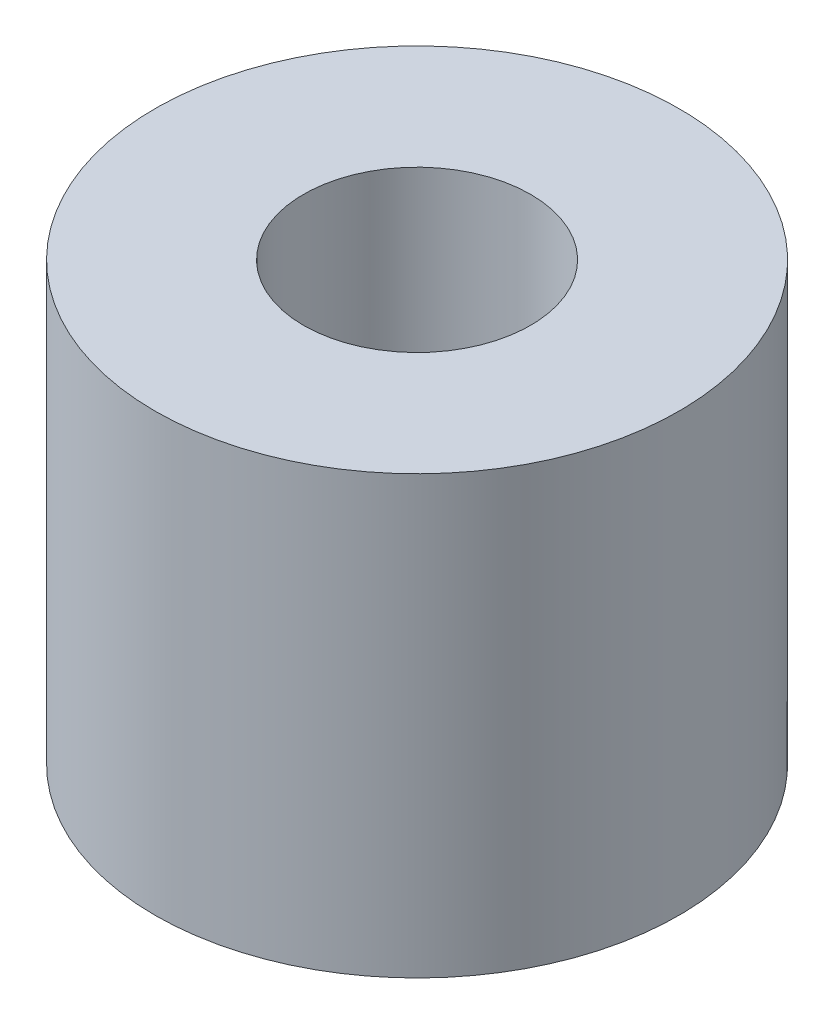
ISO-10303-21;
HEADER;
FILE_DESCRIPTION(('STEP AP214'),'2;1');
FILE_NAME('part.step','',(''),(''),'','','');
FILE_SCHEMA(('AUTOMOTIVE_DESIGN { 1 0 10303 214 1 1 1 1 }'));
ENDSEC;
DATA;
#1=APPLICATION_CONTEXT('core data for automotive mechanical design processes');
#2=APPLICATION_PROTOCOL_DEFINITION('international standard','automotive_design',2000,#1);
#3=PRODUCT_CONTEXT('',#1,'mechanical');
#4=PRODUCT('Part','Part','',(#3));
#5=PRODUCT_RELATED_PRODUCT_CATEGORY('part','',(#4));
#6=PRODUCT_DEFINITION_FORMATION('','',#4);
#7=PRODUCT_DEFINITION_CONTEXT('part definition',#1,'design');
#8=PRODUCT_DEFINITION('design','',#6,#7);
#9=PRODUCT_DEFINITION_SHAPE('','',#8);
#10=(LENGTH_UNIT() NAMED_UNIT(*) SI_UNIT(.MILLI.,.METRE.));
#11=(NAMED_UNIT(*) PLANE_ANGLE_UNIT() SI_UNIT($,.RADIAN.));
#12=(NAMED_UNIT(*) SI_UNIT($,.STERADIAN.) SOLID_ANGLE_UNIT());
#13=UNCERTAINTY_MEASURE_WITH_UNIT(LENGTH_MEASURE(1.E-05),#10,'distance_accuracy_value','');
#14=(GEOMETRIC_REPRESENTATION_CONTEXT(3) GLOBAL_UNCERTAINTY_ASSIGNED_CONTEXT((#13)) GLOBAL_UNIT_ASSIGNED_CONTEXT((#10,
#11,#12)) REPRESENTATION_CONTEXT('',''));
#15=CARTESIAN_POINT('',(0.,0.,0.));
#16=DIRECTION('',(0.,0.,1.));
#17=DIRECTION('',(1.,0.,0.));
#18=AXIS2_PLACEMENT_3D('',#15,#16,#17);
#19=CARTESIAN_POINT('',(0.,5.,0.));
#20=DIRECTION('',(0.,1.,0.));
#21=DIRECTION('',(0.,0.,1.));
#22=AXIS2_PLACEMENT_3D('',#19,#20,#21);
#23=PLANE('',#22);
#24=CARTESIAN_POINT('',(0.,5.,0.));
#25=DIRECTION('',(0.,1.,0.));
#26=DIRECTION('',(0.,0.,1.));
#27=AXIS2_PLACEMENT_3D('',#24,#25,#26);
#28=CIRCLE('',#27,3.);
#29=CARTESIAN_POINT('',(0.,5.,3.));
#30=VERTEX_POINT('',#29);
#31=EDGE_CURVE('E10',#30,#30,#28,.T.);
#32=ORIENTED_EDGE('',*,*,#31,.T.);
#33=EDGE_LOOP('',(#32));
#34=FACE_BOUND('',#33,.T.);
#35=CARTESIAN_POINT('',(0.,5.,0.));
#36=DIRECTION('',(0.,1.,0.));
#37=DIRECTION('',(0.,0.,1.));
#38=AXIS2_PLACEMENT_3D('',#35,#36,#37);
#39=CIRCLE('',#38,1.3);
#40=CARTESIAN_POINT('',(0.,5.,1.3));
#41=VERTEX_POINT('',#40);
#42=EDGE_CURVE('E46',#41,#41,#39,.T.);
#43=ORIENTED_EDGE('',*,*,#42,.F.);
#44=EDGE_LOOP('',(#43));
#45=FACE_BOUND('',#44,.T.);
#46=ADVANCED_FACE('F35',(#34,#45),#23,.T.);
#47=CARTESIAN_POINT('',(0.,0.,0.));
#48=DIRECTION('',(0.,1.,0.));
#49=DIRECTION('',(0.,0.,1.));
#50=AXIS2_PLACEMENT_3D('',#47,#48,#49);
#51=PLANE('',#50);
#52=CARTESIAN_POINT('',(0.,0.,0.));
#53=DIRECTION('',(0.,1.,0.));
#54=DIRECTION('',(0.,0.,1.));
#55=AXIS2_PLACEMENT_3D('',#52,#53,#54);
#56=CIRCLE('',#55,3.);
#57=CARTESIAN_POINT('',(0.,0.,3.));
#58=VERTEX_POINT('',#57);
#59=EDGE_CURVE('E39',#58,#58,#56,.T.);
#60=ORIENTED_EDGE('',*,*,#59,.F.);
#61=EDGE_LOOP('',(#60));
#62=FACE_BOUND('',#61,.T.);
#63=CARTESIAN_POINT('',(0.,0.,0.));
#64=DIRECTION('',(0.,1.,0.));
#65=DIRECTION('',(0.,0.,1.));
#66=AXIS2_PLACEMENT_3D('',#63,#64,#65);
#67=CIRCLE('',#66,1.3);
#68=CARTESIAN_POINT('',(0.,0.,1.3));
#69=VERTEX_POINT('',#68);
#70=EDGE_CURVE('E48',#69,#69,#67,.T.);
#71=ORIENTED_EDGE('',*,*,#70,.T.);
#72=EDGE_LOOP('',(#71));
#73=FACE_BOUND('',#72,.T.);
#74=ADVANCED_FACE('F58',(#62,#73),#51,.F.);
#75=CARTESIAN_POINT('',(0.,5.,0.));
#76=DIRECTION('',(0.,-1.,0.));
#77=DIRECTION('',(0.,0.,-1.));
#78=AXIS2_PLACEMENT_3D('',#75,#76,#77);
#79=CYLINDRICAL_SURFACE('',#78,3.);
#80=ORIENTED_EDGE('',*,*,#31,.F.);
#81=EDGE_LOOP('',(#80));
#82=FACE_BOUND('',#81,.T.);
#83=ORIENTED_EDGE('',*,*,#59,.T.);
#84=EDGE_LOOP('',(#83));
#85=FACE_BOUND('',#84,.T.);
#86=ADVANCED_FACE('F37',(#82,#85),#79,.T.);
#87=CARTESIAN_POINT('',(0.,5.,0.));
#88=DIRECTION('',(0.,-1.,0.));
#89=DIRECTION('',(0.,0.,-1.));
#90=AXIS2_PLACEMENT_3D('',#87,#88,#89);
#91=CYLINDRICAL_SURFACE('',#90,1.3);
#92=ORIENTED_EDGE('',*,*,#42,.T.);
#93=EDGE_LOOP('',(#92));
#94=FACE_BOUND('',#93,.T.);
#95=ORIENTED_EDGE('',*,*,#70,.F.);
#96=EDGE_LOOP('',(#95));
#97=FACE_BOUND('',#96,.T.);
#98=ADVANCED_FACE('F54',(#94,#97),#91,.F.);
#99=CLOSED_SHELL('',(#46,#74,#86,#98));
#100=MANIFOLD_SOLID_BREP('B2',#99);
#101=ADVANCED_BREP_SHAPE_REPRESENTATION('',(#18,#100),#14);
#102=SHAPE_DEFINITION_REPRESENTATION(#9,#101);
ENDSEC;
END-ISO-10303-21;
